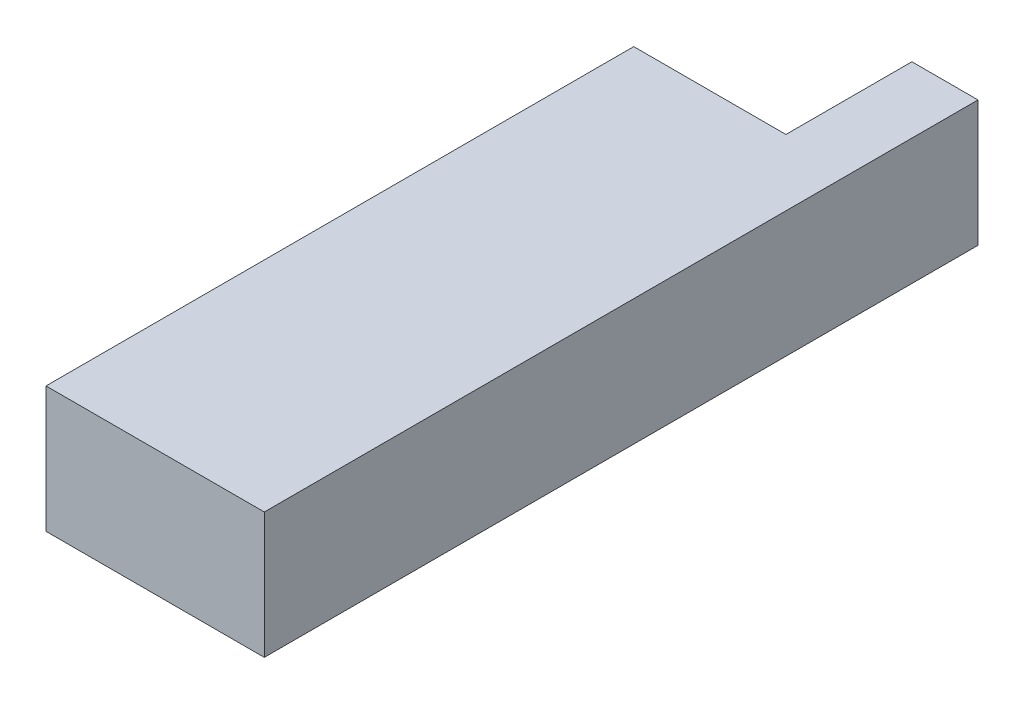
ISO-10303-21;
HEADER;
FILE_DESCRIPTION(('STEP AP214'),'2;1');
FILE_NAME('part.step','',(''),(''),'','','');
FILE_SCHEMA(('AUTOMOTIVE_DESIGN { 1 0 10303 214 1 1 1 1 }'));
ENDSEC;
DATA;
#1=APPLICATION_CONTEXT('core data for automotive mechanical design processes');
#2=APPLICATION_PROTOCOL_DEFINITION('international standard','automotive_design',2000,#1);
#3=PRODUCT_CONTEXT('',#1,'mechanical');
#4=PRODUCT('Part','Part','',(#3));
#5=PRODUCT_RELATED_PRODUCT_CATEGORY('part','',(#4));
#6=PRODUCT_DEFINITION_FORMATION('','',#4);
#7=PRODUCT_DEFINITION_CONTEXT('part definition',#1,'design');
#8=PRODUCT_DEFINITION('design','',#6,#7);
#9=PRODUCT_DEFINITION_SHAPE('','',#8);
#10=(LENGTH_UNIT() NAMED_UNIT(*) SI_UNIT(.MILLI.,.METRE.));
#11=(NAMED_UNIT(*) PLANE_ANGLE_UNIT() SI_UNIT($,.RADIAN.));
#12=(NAMED_UNIT(*) SI_UNIT($,.STERADIAN.) SOLID_ANGLE_UNIT());
#13=UNCERTAINTY_MEASURE_WITH_UNIT(LENGTH_MEASURE(1.E-05),#10,'distance_accuracy_value','');
#14=(GEOMETRIC_REPRESENTATION_CONTEXT(3) GLOBAL_UNCERTAINTY_ASSIGNED_CONTEXT((#13)) GLOBAL_UNIT_ASSIGNED_CONTEXT((#10,
#11,#12)) REPRESENTATION_CONTEXT('',''));
#15=CARTESIAN_POINT('',(0.,0.,0.));
#16=DIRECTION('',(0.,0.,1.));
#17=DIRECTION('',(1.,0.,0.));
#18=AXIS2_PLACEMENT_3D('',#15,#16,#17);
#19=CARTESIAN_POINT('',(-16.51,9.525,-44.45));
#20=DIRECTION('',(0.,0.,1.));
#21=DIRECTION('',(1.,0.,0.));
#22=AXIS2_PLACEMENT_3D('',#19,#20,#21);
#23=PLANE('',#22);
#24=DIRECTION('',(0.,1.,0.));
#25=VECTOR('',#24,1.);
#26=CARTESIAN_POINT('',(6.51,9.525,-44.45));
#27=LINE('',#26,#25);
#28=CARTESIAN_POINT('',(6.51,-9.525,-44.45));
#29=VERTEX_POINT('',#28);
#30=CARTESIAN_POINT('',(6.51,9.525,-44.45));
#31=VERTEX_POINT('',#30);
#32=EDGE_CURVE('E59',#29,#31,#27,.T.);
#33=ORIENTED_EDGE('',*,*,#32,.F.);
#34=DIRECTION('',(-1.,0.,0.));
#35=VECTOR('',#34,1.);
#36=CARTESIAN_POINT('',(-16.51,-9.525,-44.45));
#37=LINE('',#36,#35);
#38=CARTESIAN_POINT('',(-16.51,-9.525,-44.45));
#39=VERTEX_POINT('',#38);
#40=EDGE_CURVE('E113',#29,#39,#37,.T.);
#41=ORIENTED_EDGE('',*,*,#40,.T.);
#42=DIRECTION('',(0.,-1.,0.));
#43=VECTOR('',#42,1.);
#44=CARTESIAN_POINT('',(-16.51,9.525,-44.45));
#45=LINE('',#44,#43);
#46=CARTESIAN_POINT('',(-16.51,9.525,-44.45));
#47=VERTEX_POINT('',#46);
#48=EDGE_CURVE('E11',#47,#39,#45,.T.);
#49=ORIENTED_EDGE('',*,*,#48,.F.);
#50=DIRECTION('',(-1.,0.,0.));
#51=VECTOR('',#50,1.);
#52=CARTESIAN_POINT('',(-16.51,9.525,-44.45));
#53=LINE('',#52,#51);
#54=EDGE_CURVE('E88',#31,#47,#53,.T.);
#55=ORIENTED_EDGE('',*,*,#54,.F.);
#56=EDGE_LOOP('',(#33,#41,#49,#55));
#57=FACE_BOUND('',#56,.T.);
#58=ADVANCED_FACE('F43',(#57),#23,.F.);
#59=CARTESIAN_POINT('',(16.51,9.525,-44.45));
#60=DIRECTION('',(-1.,0.,0.));
#61=DIRECTION('',(0.,0.,1.));
#62=AXIS2_PLACEMENT_3D('',#59,#60,#61);
#63=PLANE('',#62);
#64=DIRECTION('',(0.,0.,-1.));
#65=VECTOR('',#64,1.);
#66=CARTESIAN_POINT('',(16.51,-9.525,-44.45));
#67=LINE('',#66,#65);
#68=CARTESIAN_POINT('',(16.51,-9.525,44.45));
#69=VERTEX_POINT('',#68);
#70=CARTESIAN_POINT('',(16.51,-9.525,-63.5));
#71=VERTEX_POINT('',#70);
#72=EDGE_CURVE('E105',#69,#71,#67,.T.);
#73=ORIENTED_EDGE('',*,*,#72,.T.);
#74=DIRECTION('',(0.,-1.,0.));
#75=VECTOR('',#74,1.);
#76=CARTESIAN_POINT('',(16.51,9.525,-63.5));
#77=LINE('',#76,#75);
#78=CARTESIAN_POINT('',(16.51,9.525,-63.5));
#79=VERTEX_POINT('',#78);
#80=EDGE_CURVE('E109',#79,#71,#77,.T.);
#81=ORIENTED_EDGE('',*,*,#80,.F.);
#82=DIRECTION('',(0.,0.,-1.));
#83=VECTOR('',#82,1.);
#84=CARTESIAN_POINT('',(16.51,9.525,-44.45));
#85=LINE('',#84,#83);
#86=CARTESIAN_POINT('',(16.51,9.525,44.45));
#87=VERTEX_POINT('',#86);
#88=EDGE_CURVE('E143',#87,#79,#85,.T.);
#89=ORIENTED_EDGE('',*,*,#88,.F.);
#90=DIRECTION('',(0.,-1.,0.));
#91=VECTOR('',#90,1.);
#92=CARTESIAN_POINT('',(16.51,9.525,44.45));
#93=LINE('',#92,#91);
#94=EDGE_CURVE('E110',#87,#69,#93,.T.);
#95=ORIENTED_EDGE('',*,*,#94,.T.);
#96=EDGE_LOOP('',(#73,#81,#89,#95));
#97=FACE_BOUND('',#96,.T.);
#98=ADVANCED_FACE('F45',(#97),#63,.F.);
#99=CARTESIAN_POINT('',(-16.51,9.525,-44.45));
#100=DIRECTION('',(1.,0.,0.));
#101=DIRECTION('',(0.,0.,-1.));
#102=AXIS2_PLACEMENT_3D('',#99,#100,#101);
#103=PLANE('',#102);
#104=DIRECTION('',(0.,0.,1.));
#105=VECTOR('',#104,1.);
#106=CARTESIAN_POINT('',(-16.51,-9.525,-44.45));
#107=LINE('',#106,#105);
#108=CARTESIAN_POINT('',(-16.51,-9.525,44.45));
#109=VERTEX_POINT('',#108);
#110=EDGE_CURVE('E155',#39,#109,#107,.T.);
#111=ORIENTED_EDGE('',*,*,#110,.T.);
#112=DIRECTION('',(0.,-1.,0.));
#113=VECTOR('',#112,1.);
#114=CARTESIAN_POINT('',(-16.51,9.525,44.45));
#115=LINE('',#114,#113);
#116=CARTESIAN_POINT('',(-16.51,9.525,44.45));
#117=VERTEX_POINT('',#116);
#118=EDGE_CURVE('E52',#117,#109,#115,.T.);
#119=ORIENTED_EDGE('',*,*,#118,.F.);
#120=DIRECTION('',(0.,0.,1.));
#121=VECTOR('',#120,1.);
#122=CARTESIAN_POINT('',(-16.51,9.525,-44.45));
#123=LINE('',#122,#121);
#124=EDGE_CURVE('E148',#47,#117,#123,.T.);
#125=ORIENTED_EDGE('',*,*,#124,.F.);
#126=ORIENTED_EDGE('',*,*,#48,.T.);
#127=EDGE_LOOP('',(#111,#119,#125,#126));
#128=FACE_BOUND('',#127,.T.);
#129=ADVANCED_FACE('F167',(#128),#103,.F.);
#130=CARTESIAN_POINT('',(-16.51,9.525,44.45));
#131=DIRECTION('',(0.,0.,-1.));
#132=DIRECTION('',(-1.,0.,0.));
#133=AXIS2_PLACEMENT_3D('',#130,#131,#132);
#134=PLANE('',#133);
#135=DIRECTION('',(1.,0.,0.));
#136=VECTOR('',#135,1.);
#137=CARTESIAN_POINT('',(-16.51,-9.525,44.45));
#138=LINE('',#137,#136);
#139=EDGE_CURVE('E84',#109,#69,#138,.T.);
#140=ORIENTED_EDGE('',*,*,#139,.T.);
#141=ORIENTED_EDGE('',*,*,#94,.F.);
#142=DIRECTION('',(1.,0.,0.));
#143=VECTOR('',#142,1.);
#144=CARTESIAN_POINT('',(-16.51,9.525,44.45));
#145=LINE('',#144,#143);
#146=EDGE_CURVE('E68',#117,#87,#145,.T.);
#147=ORIENTED_EDGE('',*,*,#146,.F.);
#148=ORIENTED_EDGE('',*,*,#118,.T.);
#149=EDGE_LOOP('',(#140,#141,#147,#148));
#150=FACE_BOUND('',#149,.T.);
#151=ADVANCED_FACE('F163',(#150),#134,.F.);
#152=CARTESIAN_POINT('',(0.,9.525,0.));
#153=DIRECTION('',(0.,1.,0.));
#154=DIRECTION('',(0.,0.,1.));
#155=AXIS2_PLACEMENT_3D('',#152,#153,#154);
#156=PLANE('',#155);
#157=ORIENTED_EDGE('',*,*,#88,.T.);
#158=DIRECTION('',(1.,0.,0.));
#159=VECTOR('',#158,1.);
#160=CARTESIAN_POINT('',(16.51,9.525,-63.5));
#161=LINE('',#160,#159);
#162=CARTESIAN_POINT('',(6.51,9.525,-63.5));
#163=VERTEX_POINT('',#162);
#164=EDGE_CURVE('E128',#163,#79,#161,.T.);
#165=ORIENTED_EDGE('',*,*,#164,.F.);
#166=DIRECTION('',(0.,0.,1.));
#167=VECTOR('',#166,1.);
#168=CARTESIAN_POINT('',(6.51,9.525,-63.5));
#169=LINE('',#168,#167);
#170=EDGE_CURVE('E137',#163,#31,#169,.T.);
#171=ORIENTED_EDGE('',*,*,#170,.T.);
#172=ORIENTED_EDGE('',*,*,#54,.T.);
#173=ORIENTED_EDGE('',*,*,#124,.T.);
#174=ORIENTED_EDGE('',*,*,#146,.T.);
#175=EDGE_LOOP('',(#157,#165,#171,#172,#173,#174));
#176=FACE_BOUND('',#175,.T.);
#177=ADVANCED_FACE('F171',(#176),#156,.T.);
#178=CARTESIAN_POINT('',(0.,-9.525,0.));
#179=DIRECTION('',(0.,1.,0.));
#180=DIRECTION('',(0.,0.,1.));
#181=AXIS2_PLACEMENT_3D('',#178,#179,#180);
#182=PLANE('',#181);
#183=ORIENTED_EDGE('',*,*,#72,.F.);
#184=ORIENTED_EDGE('',*,*,#139,.F.);
#185=ORIENTED_EDGE('',*,*,#110,.F.);
#186=ORIENTED_EDGE('',*,*,#40,.F.);
#187=DIRECTION('',(0.,0.,1.));
#188=VECTOR('',#187,1.);
#189=CARTESIAN_POINT('',(6.51,-9.525,-63.5));
#190=LINE('',#189,#188);
#191=CARTESIAN_POINT('',(6.51,-9.525,-63.5));
#192=VERTEX_POINT('',#191);
#193=EDGE_CURVE('E114',#192,#29,#190,.T.);
#194=ORIENTED_EDGE('',*,*,#193,.F.);
#195=DIRECTION('',(-1.,0.,0.));
#196=VECTOR('',#195,1.);
#197=CARTESIAN_POINT('',(16.51,-9.525,-63.5));
#198=LINE('',#197,#196);
#199=EDGE_CURVE('E117',#71,#192,#198,.T.);
#200=ORIENTED_EDGE('',*,*,#199,.F.);
#201=EDGE_LOOP('',(#183,#184,#185,#186,#194,#200));
#202=FACE_BOUND('',#201,.T.);
#203=ADVANCED_FACE('F118',(#202),#182,.F.);
#204=CARTESIAN_POINT('',(6.51,9.525,-63.5));
#205=DIRECTION('',(1.,0.,0.));
#206=DIRECTION('',(0.,1.,0.));
#207=AXIS2_PLACEMENT_3D('',#204,#205,#206);
#208=PLANE('',#207);
#209=ORIENTED_EDGE('',*,*,#32,.T.);
#210=ORIENTED_EDGE('',*,*,#170,.F.);
#211=DIRECTION('',(0.,1.,0.));
#212=VECTOR('',#211,1.);
#213=CARTESIAN_POINT('',(6.51,9.525,-63.5));
#214=LINE('',#213,#212);
#215=EDGE_CURVE('E123',#192,#163,#214,.T.);
#216=ORIENTED_EDGE('',*,*,#215,.F.);
#217=ORIENTED_EDGE('',*,*,#193,.T.);
#218=EDGE_LOOP('',(#209,#210,#216,#217));
#219=FACE_BOUND('',#218,.T.);
#220=ADVANCED_FACE('F170',(#219),#208,.F.);
#221=CARTESIAN_POINT('',(0.,0.,-63.5));
#222=DIRECTION('',(0.,0.,-1.));
#223=DIRECTION('',(-1.,0.,0.));
#224=AXIS2_PLACEMENT_3D('',#221,#222,#223);
#225=PLANE('',#224);
#226=ORIENTED_EDGE('',*,*,#80,.T.);
#227=ORIENTED_EDGE('',*,*,#199,.T.);
#228=ORIENTED_EDGE('',*,*,#215,.T.);
#229=ORIENTED_EDGE('',*,*,#164,.T.);
#230=EDGE_LOOP('',(#226,#227,#228,#229));
#231=FACE_BOUND('',#230,.T.);
#232=ADVANCED_FACE('F126',(#231),#225,.T.);
#233=CLOSED_SHELL('',(#58,#98,#129,#151,#177,#203,#220,#232));
#234=MANIFOLD_SOLID_BREP('B2',#233);
#235=ADVANCED_BREP_SHAPE_REPRESENTATION('',(#18,#234),#14);
#236=SHAPE_DEFINITION_REPRESENTATION(#9,#235);
ENDSEC;
END-ISO-10303-21;
